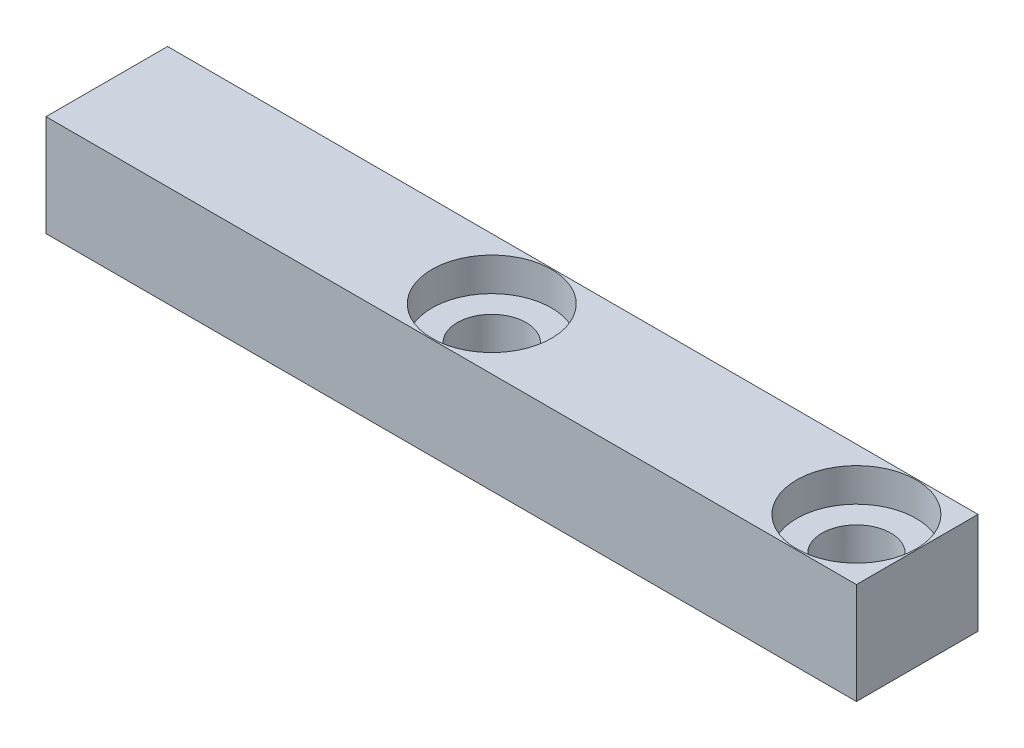
ISO-10303-21;
HEADER;
FILE_DESCRIPTION(('STEP AP214'),'2;1');
FILE_NAME('part.step','',(''),(''),'','','');
FILE_SCHEMA(('AUTOMOTIVE_DESIGN { 1 0 10303 214 1 1 1 1 }'));
ENDSEC;
DATA;
#1=APPLICATION_CONTEXT('core data for automotive mechanical design processes');
#2=APPLICATION_PROTOCOL_DEFINITION('international standard','automotive_design',2000,#1);
#3=PRODUCT_CONTEXT('',#1,'mechanical');
#4=PRODUCT('Part','Part','',(#3));
#5=PRODUCT_RELATED_PRODUCT_CATEGORY('part','',(#4));
#6=PRODUCT_DEFINITION_FORMATION('','',#4);
#7=PRODUCT_DEFINITION_CONTEXT('part definition',#1,'design');
#8=PRODUCT_DEFINITION('design','',#6,#7);
#9=PRODUCT_DEFINITION_SHAPE('','',#8);
#10=(LENGTH_UNIT() NAMED_UNIT(*) SI_UNIT(.MILLI.,.METRE.));
#11=(NAMED_UNIT(*) PLANE_ANGLE_UNIT() SI_UNIT($,.RADIAN.));
#12=(NAMED_UNIT(*) SI_UNIT($,.STERADIAN.) SOLID_ANGLE_UNIT());
#13=UNCERTAINTY_MEASURE_WITH_UNIT(LENGTH_MEASURE(1.E-05),#10,'distance_accuracy_value','');
#14=(GEOMETRIC_REPRESENTATION_CONTEXT(3) GLOBAL_UNCERTAINTY_ASSIGNED_CONTEXT((#13)) GLOBAL_UNIT_ASSIGNED_CONTEXT((#10,
#11,#12)) REPRESENTATION_CONTEXT('',''));
#15=CARTESIAN_POINT('',(0.,0.,0.));
#16=DIRECTION('',(0.,0.,1.));
#17=DIRECTION('',(1.,0.,0.));
#18=AXIS2_PLACEMENT_3D('',#15,#16,#17);
#19=CARTESIAN_POINT('',(0.,5.,0.));
#20=DIRECTION('',(1.,0.,0.));
#21=DIRECTION('',(0.,0.,-1.));
#22=AXIS2_PLACEMENT_3D('',#19,#20,#21);
#23=PLANE('',#22);
#24=DIRECTION('',(0.,0.,1.));
#25=VECTOR('',#24,1.);
#26=CARTESIAN_POINT('',(0.,0.,0.));
#27=LINE('',#26,#25);
#28=CARTESIAN_POINT('',(0.,0.,-6.));
#29=VERTEX_POINT('',#28);
#30=CARTESIAN_POINT('',(0.,0.,0.));
#31=VERTEX_POINT('',#30);
#32=EDGE_CURVE('E99',#29,#31,#27,.T.);
#33=ORIENTED_EDGE('',*,*,#32,.T.);
#34=DIRECTION('',(0.,-1.,0.));
#35=VECTOR('',#34,1.);
#36=CARTESIAN_POINT('',(0.,5.,0.));
#37=LINE('',#36,#35);
#38=CARTESIAN_POINT('',(0.,5.,0.));
#39=VERTEX_POINT('',#38);
#40=EDGE_CURVE('E11',#39,#31,#37,.T.);
#41=ORIENTED_EDGE('',*,*,#40,.F.);
#42=DIRECTION('',(0.,0.,1.));
#43=VECTOR('',#42,1.);
#44=CARTESIAN_POINT('',(0.,5.,0.));
#45=LINE('',#44,#43);
#46=CARTESIAN_POINT('',(0.,5.,-6.));
#47=VERTEX_POINT('',#46);
#48=EDGE_CURVE('E86',#47,#39,#45,.T.);
#49=ORIENTED_EDGE('',*,*,#48,.F.);
#50=DIRECTION('',(0.,-1.,0.));
#51=VECTOR('',#50,1.);
#52=CARTESIAN_POINT('',(0.,5.,-6.));
#53=LINE('',#52,#51);
#54=EDGE_CURVE('E95',#47,#29,#53,.T.);
#55=ORIENTED_EDGE('',*,*,#54,.T.);
#56=EDGE_LOOP('',(#33,#41,#49,#55));
#57=FACE_BOUND('',#56,.T.);
#58=ADVANCED_FACE('F33',(#57),#23,.F.);
#59=CARTESIAN_POINT('',(0.,5.,0.));
#60=DIRECTION('',(0.,0.,-1.));
#61=DIRECTION('',(-1.,0.,0.));
#62=AXIS2_PLACEMENT_3D('',#59,#60,#61);
#63=PLANE('',#62);
#64=DIRECTION('',(1.,0.,0.));
#65=VECTOR('',#64,1.);
#66=CARTESIAN_POINT('',(0.,0.,0.));
#67=LINE('',#66,#65);
#68=CARTESIAN_POINT('',(40.,0.,0.));
#69=VERTEX_POINT('',#68);
#70=EDGE_CURVE('E90',#31,#69,#67,.T.);
#71=ORIENTED_EDGE('',*,*,#70,.T.);
#72=DIRECTION('',(0.,-1.,0.));
#73=VECTOR('',#72,1.);
#74=CARTESIAN_POINT('',(40.,5.,0.));
#75=LINE('',#74,#73);
#76=CARTESIAN_POINT('',(40.,5.,0.));
#77=VERTEX_POINT('',#76);
#78=EDGE_CURVE('E42',#77,#69,#75,.T.);
#79=ORIENTED_EDGE('',*,*,#78,.F.);
#80=DIRECTION('',(1.,0.,0.));
#81=VECTOR('',#80,1.);
#82=CARTESIAN_POINT('',(0.,5.,0.));
#83=LINE('',#82,#81);
#84=EDGE_CURVE('E81',#39,#77,#83,.T.);
#85=ORIENTED_EDGE('',*,*,#84,.F.);
#86=ORIENTED_EDGE('',*,*,#40,.T.);
#87=EDGE_LOOP('',(#71,#79,#85,#86));
#88=FACE_BOUND('',#87,.T.);
#89=ADVANCED_FACE('F89',(#88),#63,.F.);
#90=CARTESIAN_POINT('',(40.,5.,0.));
#91=DIRECTION('',(-1.,0.,0.));
#92=DIRECTION('',(0.,0.,1.));
#93=AXIS2_PLACEMENT_3D('',#90,#91,#92);
#94=PLANE('',#93);
#95=DIRECTION('',(0.,0.,-1.));
#96=VECTOR('',#95,1.);
#97=CARTESIAN_POINT('',(40.,0.,0.));
#98=LINE('',#97,#96);
#99=CARTESIAN_POINT('',(40.,0.,-6.));
#100=VERTEX_POINT('',#99);
#101=EDGE_CURVE('E68',#69,#100,#98,.T.);
#102=ORIENTED_EDGE('',*,*,#101,.T.);
#103=DIRECTION('',(0.,-1.,0.));
#104=VECTOR('',#103,1.);
#105=CARTESIAN_POINT('',(40.,5.,-6.));
#106=LINE('',#105,#104);
#107=CARTESIAN_POINT('',(40.,5.,-6.));
#108=VERTEX_POINT('',#107);
#109=EDGE_CURVE('E91',#108,#100,#106,.T.);
#110=ORIENTED_EDGE('',*,*,#109,.F.);
#111=DIRECTION('',(0.,0.,-1.));
#112=VECTOR('',#111,1.);
#113=CARTESIAN_POINT('',(40.,5.,0.));
#114=LINE('',#113,#112);
#115=EDGE_CURVE('E84',#77,#108,#114,.T.);
#116=ORIENTED_EDGE('',*,*,#115,.F.);
#117=ORIENTED_EDGE('',*,*,#78,.T.);
#118=EDGE_LOOP('',(#102,#110,#116,#117));
#119=FACE_BOUND('',#118,.T.);
#120=ADVANCED_FACE('F93',(#119),#94,.F.);
#121=CARTESIAN_POINT('',(0.,5.,-6.));
#122=DIRECTION('',(0.,0.,1.));
#123=DIRECTION('',(1.,0.,0.));
#124=AXIS2_PLACEMENT_3D('',#121,#122,#123);
#125=PLANE('',#124);
#126=DIRECTION('',(-1.,0.,0.));
#127=VECTOR('',#126,1.);
#128=CARTESIAN_POINT('',(0.,0.,-6.));
#129=LINE('',#128,#127);
#130=EDGE_CURVE('E74',#100,#29,#129,.T.);
#131=ORIENTED_EDGE('',*,*,#130,.T.);
#132=ORIENTED_EDGE('',*,*,#54,.F.);
#133=DIRECTION('',(-1.,0.,0.));
#134=VECTOR('',#133,1.);
#135=CARTESIAN_POINT('',(0.,5.,-6.));
#136=LINE('',#135,#134);
#137=EDGE_CURVE('E51',#108,#47,#136,.T.);
#138=ORIENTED_EDGE('',*,*,#137,.F.);
#139=ORIENTED_EDGE('',*,*,#109,.T.);
#140=EDGE_LOOP('',(#131,#132,#138,#139));
#141=FACE_BOUND('',#140,.T.);
#142=ADVANCED_FACE('F137',(#141),#125,.F.);
#143=CARTESIAN_POINT('',(0.,5.,0.));
#144=DIRECTION('',(0.,-1.,0.));
#145=DIRECTION('',(0.,0.,-1.));
#146=AXIS2_PLACEMENT_3D('',#143,#144,#145);
#147=PLANE('',#146);
#148=CARTESIAN_POINT('',(37.,5.,-3.));
#149=DIRECTION('',(0.,1.,0.));
#150=DIRECTION('',(0.,0.,1.));
#151=AXIS2_PLACEMENT_3D('',#148,#149,#150);
#152=CIRCLE('',#151,2.95);
#153=CARTESIAN_POINT('',(37.,5.,-0.0499999999999988));
#154=VERTEX_POINT('',#153);
#155=EDGE_CURVE('E128',#154,#154,#152,.T.);
#156=ORIENTED_EDGE('',*,*,#155,.F.);
#157=EDGE_LOOP('',(#156));
#158=FACE_BOUND('',#157,.T.);
#159=CARTESIAN_POINT('',(19.,5.,-3.));
#160=DIRECTION('',(0.,1.,0.));
#161=DIRECTION('',(0.,0.,1.));
#162=AXIS2_PLACEMENT_3D('',#159,#160,#161);
#163=CIRCLE('',#162,2.95);
#164=CARTESIAN_POINT('',(19.,5.,-0.0499999999999988));
#165=VERTEX_POINT('',#164);
#166=EDGE_CURVE('E117',#165,#165,#163,.T.);
#167=ORIENTED_EDGE('',*,*,#166,.F.);
#168=EDGE_LOOP('',(#167));
#169=FACE_BOUND('',#168,.T.);
#170=ORIENTED_EDGE('',*,*,#48,.T.);
#171=ORIENTED_EDGE('',*,*,#84,.T.);
#172=ORIENTED_EDGE('',*,*,#115,.T.);
#173=ORIENTED_EDGE('',*,*,#137,.T.);
#174=EDGE_LOOP('',(#170,#171,#172,#173));
#175=FACE_BOUND('',#174,.T.);
#176=ADVANCED_FACE('F82',(#158,#169,#175),#147,.F.);
#177=CARTESIAN_POINT('',(0.,0.,0.));
#178=DIRECTION('',(0.,-1.,0.));
#179=DIRECTION('',(0.,0.,-1.));
#180=AXIS2_PLACEMENT_3D('',#177,#178,#179);
#181=PLANE('',#180);
#182=CARTESIAN_POINT('',(37.,0.,-3.));
#183=DIRECTION('',(0.,-1.,0.));
#184=DIRECTION('',(0.,0.,-1.));
#185=AXIS2_PLACEMENT_3D('',#182,#183,#184);
#186=CIRCLE('',#185,1.7);
#187=CARTESIAN_POINT('',(37.,0.,-4.7));
#188=VERTEX_POINT('',#187);
#189=EDGE_CURVE('E36',#188,#188,#186,.T.);
#190=ORIENTED_EDGE('',*,*,#189,.F.);
#191=EDGE_LOOP('',(#190));
#192=FACE_BOUND('',#191,.T.);
#193=CARTESIAN_POINT('',(19.,0.,-3.));
#194=DIRECTION('',(0.,-1.,0.));
#195=DIRECTION('',(0.,0.,-1.));
#196=AXIS2_PLACEMENT_3D('',#193,#194,#195);
#197=CIRCLE('',#196,1.7);
#198=CARTESIAN_POINT('',(19.,0.,-4.7));
#199=VERTEX_POINT('',#198);
#200=EDGE_CURVE('E102',#199,#199,#197,.T.);
#201=ORIENTED_EDGE('',*,*,#200,.F.);
#202=EDGE_LOOP('',(#201));
#203=FACE_BOUND('',#202,.T.);
#204=ORIENTED_EDGE('',*,*,#32,.F.);
#205=ORIENTED_EDGE('',*,*,#130,.F.);
#206=ORIENTED_EDGE('',*,*,#101,.F.);
#207=ORIENTED_EDGE('',*,*,#70,.F.);
#208=EDGE_LOOP('',(#204,#205,#206,#207));
#209=FACE_BOUND('',#208,.T.);
#210=ADVANCED_FACE('F136',(#192,#203,#209),#181,.T.);
#211=CARTESIAN_POINT('',(19.,5.,-3.));
#212=DIRECTION('',(0.,1.,0.));
#213=DIRECTION('',(0.,0.,1.));
#214=AXIS2_PLACEMENT_3D('',#211,#212,#213);
#215=CYLINDRICAL_SURFACE('',#214,1.7);
#216=ORIENTED_EDGE('',*,*,#200,.T.);
#217=EDGE_LOOP('',(#216));
#218=FACE_BOUND('',#217,.T.);
#219=CARTESIAN_POINT('',(19.,3.35,-3.));
#220=DIRECTION('',(0.,1.,0.));
#221=DIRECTION('',(0.,0.,1.));
#222=AXIS2_PLACEMENT_3D('',#219,#220,#221);
#223=CIRCLE('',#222,1.7);
#224=CARTESIAN_POINT('',(19.,3.35,-1.3));
#225=VERTEX_POINT('',#224);
#226=EDGE_CURVE('E108',#225,#225,#223,.T.);
#227=ORIENTED_EDGE('',*,*,#226,.T.);
#228=EDGE_LOOP('',(#227));
#229=FACE_BOUND('',#228,.T.);
#230=ADVANCED_FACE('F154',(#218,#229),#215,.F.);
#231=CARTESIAN_POINT('',(20.7,3.35,-3.));
#232=DIRECTION('',(0.,-1.,0.));
#233=DIRECTION('',(0.,0.,-1.));
#234=AXIS2_PLACEMENT_3D('',#231,#232,#233);
#235=PLANE('',#234);
#236=ORIENTED_EDGE('',*,*,#226,.F.);
#237=EDGE_LOOP('',(#236));
#238=FACE_BOUND('',#237,.T.);
#239=CARTESIAN_POINT('',(19.,3.35,-3.));
#240=DIRECTION('',(0.,1.,0.));
#241=DIRECTION('',(0.,0.,1.));
#242=AXIS2_PLACEMENT_3D('',#239,#240,#241);
#243=CIRCLE('',#242,2.95);
#244=CARTESIAN_POINT('',(19.,3.35,-0.0499999999999988));
#245=VERTEX_POINT('',#244);
#246=EDGE_CURVE('E112',#245,#245,#243,.T.);
#247=ORIENTED_EDGE('',*,*,#246,.T.);
#248=EDGE_LOOP('',(#247));
#249=FACE_BOUND('',#248,.T.);
#250=ADVANCED_FACE('F144',(#238,#249),#235,.F.);
#251=CARTESIAN_POINT('',(19.,5.,-3.));
#252=DIRECTION('',(0.,1.,0.));
#253=DIRECTION('',(0.,0.,1.));
#254=AXIS2_PLACEMENT_3D('',#251,#252,#253);
#255=CYLINDRICAL_SURFACE('',#254,2.95);
#256=ORIENTED_EDGE('',*,*,#246,.F.);
#257=EDGE_LOOP('',(#256));
#258=FACE_BOUND('',#257,.T.);
#259=ORIENTED_EDGE('',*,*,#166,.T.);
#260=EDGE_LOOP('',(#259));
#261=FACE_BOUND('',#260,.T.);
#262=ADVANCED_FACE('F141',(#258,#261),#255,.F.);
#263=CARTESIAN_POINT('',(37.,5.,-3.));
#264=DIRECTION('',(0.,1.,0.));
#265=DIRECTION('',(0.,0.,1.));
#266=AXIS2_PLACEMENT_3D('',#263,#264,#265);
#267=CYLINDRICAL_SURFACE('',#266,1.7);
#268=ORIENTED_EDGE('',*,*,#189,.T.);
#269=EDGE_LOOP('',(#268));
#270=FACE_BOUND('',#269,.T.);
#271=CARTESIAN_POINT('',(37.,3.35,-3.));
#272=DIRECTION('',(0.,1.,0.));
#273=DIRECTION('',(0.,0.,1.));
#274=AXIS2_PLACEMENT_3D('',#271,#272,#273);
#275=CIRCLE('',#274,1.7);
#276=CARTESIAN_POINT('',(37.,3.35,-1.3));
#277=VERTEX_POINT('',#276);
#278=EDGE_CURVE('E122',#277,#277,#275,.T.);
#279=ORIENTED_EDGE('',*,*,#278,.T.);
#280=EDGE_LOOP('',(#279));
#281=FACE_BOUND('',#280,.T.);
#282=ADVANCED_FACE('F143',(#270,#281),#267,.F.);
#283=CARTESIAN_POINT('',(38.7,3.35,-3.));
#284=DIRECTION('',(0.,-1.,0.));
#285=DIRECTION('',(0.,0.,-1.));
#286=AXIS2_PLACEMENT_3D('',#283,#284,#285);
#287=PLANE('',#286);
#288=ORIENTED_EDGE('',*,*,#278,.F.);
#289=EDGE_LOOP('',(#288));
#290=FACE_BOUND('',#289,.T.);
#291=CARTESIAN_POINT('',(37.,3.35,-3.));
#292=DIRECTION('',(0.,1.,0.));
#293=DIRECTION('',(0.,0.,1.));
#294=AXIS2_PLACEMENT_3D('',#291,#292,#293);
#295=CIRCLE('',#294,2.95);
#296=CARTESIAN_POINT('',(37.,3.35,-0.0499999999999988));
#297=VERTEX_POINT('',#296);
#298=EDGE_CURVE('E125',#297,#297,#295,.T.);
#299=ORIENTED_EDGE('',*,*,#298,.T.);
#300=EDGE_LOOP('',(#299));
#301=FACE_BOUND('',#300,.T.);
#302=ADVANCED_FACE('F151',(#290,#301),#287,.F.);
#303=CARTESIAN_POINT('',(37.,5.,-3.));
#304=DIRECTION('',(0.,1.,0.));
#305=DIRECTION('',(0.,0.,1.));
#306=AXIS2_PLACEMENT_3D('',#303,#304,#305);
#307=CYLINDRICAL_SURFACE('',#306,2.95);
#308=ORIENTED_EDGE('',*,*,#298,.F.);
#309=EDGE_LOOP('',(#308));
#310=FACE_BOUND('',#309,.T.);
#311=ORIENTED_EDGE('',*,*,#155,.T.);
#312=EDGE_LOOP('',(#311));
#313=FACE_BOUND('',#312,.T.);
#314=ADVANCED_FACE('F132',(#310,#313),#307,.F.);
#315=CLOSED_SHELL('',(#58,#89,#120,#142,#176,#210,#230,#250,#262,#282,#302,#314));
#316=MANIFOLD_SOLID_BREP('B2',#315);
#317=ADVANCED_BREP_SHAPE_REPRESENTATION('',(#18,#316),#14);
#318=SHAPE_DEFINITION_REPRESENTATION(#9,#317);
ENDSEC;
END-ISO-10303-21;
